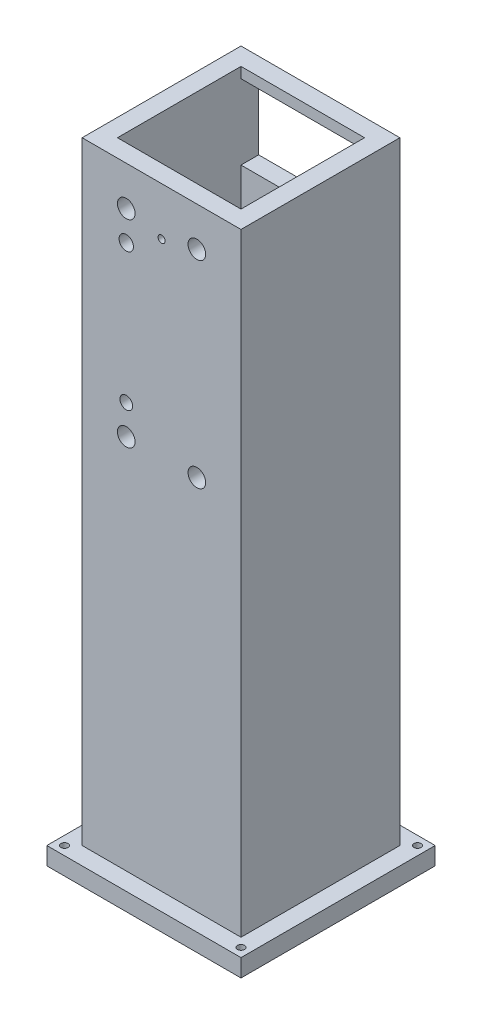
ISO-10303-21;
HEADER;
FILE_DESCRIPTION(('STEP AP214'),'2;1');
FILE_NAME('part.step','',(''),(''),'','','');
FILE_SCHEMA(('AUTOMOTIVE_DESIGN { 1 0 10303 214 1 1 1 1 }'));
ENDSEC;
DATA;
#1=APPLICATION_CONTEXT('core data for automotive mechanical design processes');
#2=APPLICATION_PROTOCOL_DEFINITION('international standard','automotive_design',2000,#1);
#3=PRODUCT_CONTEXT('',#1,'mechanical');
#4=PRODUCT('Part','Part','',(#3));
#5=PRODUCT_RELATED_PRODUCT_CATEGORY('part','',(#4));
#6=PRODUCT_DEFINITION_FORMATION('','',#4);
#7=PRODUCT_DEFINITION_CONTEXT('part definition',#1,'design');
#8=PRODUCT_DEFINITION('design','',#6,#7);
#9=PRODUCT_DEFINITION_SHAPE('','',#8);
#10=(LENGTH_UNIT() NAMED_UNIT(*) SI_UNIT(.MILLI.,.METRE.));
#11=(NAMED_UNIT(*) PLANE_ANGLE_UNIT() SI_UNIT($,.RADIAN.));
#12=(NAMED_UNIT(*) SI_UNIT($,.STERADIAN.) SOLID_ANGLE_UNIT());
#13=UNCERTAINTY_MEASURE_WITH_UNIT(LENGTH_MEASURE(1.E-05),#10,'distance_accuracy_value','');
#14=(GEOMETRIC_REPRESENTATION_CONTEXT(3) GLOBAL_UNCERTAINTY_ASSIGNED_CONTEXT((#13)) GLOBAL_UNIT_ASSIGNED_CONTEXT((#10,
#11,#12)) REPRESENTATION_CONTEXT('',''));
#15=CARTESIAN_POINT('',(0.,0.,0.));
#16=DIRECTION('',(0.,0.,1.));
#17=DIRECTION('',(1.,0.,0.));
#18=AXIS2_PLACEMENT_3D('',#15,#16,#17);
#19=CARTESIAN_POINT('',(-17.5,0.,-17.5));
#20=DIRECTION('',(0.,0.,1.));
#21=DIRECTION('',(1.,0.,0.));
#22=AXIS2_PLACEMENT_3D('',#19,#20,#21);
#23=PLANE('',#22);
#24=DIRECTION('',(1.,0.,0.));
#25=VECTOR('',#24,1.);
#26=CARTESIAN_POINT('',(-17.5,273.612120728358,-17.5));
#27=LINE('',#26,#25);
#28=CARTESIAN_POINT('',(-17.5,273.612120728358,-17.5));
#29=VERTEX_POINT('',#28);
#30=CARTESIAN_POINT('',(17.5,273.612120728358,-17.5));
#31=VERTEX_POINT('',#30);
#32=EDGE_CURVE('E267',#29,#31,#27,.T.);
#33=ORIENTED_EDGE('',*,*,#32,.F.);
#34=DIRECTION('',(0.,1.,0.));
#35=VECTOR('',#34,1.);
#36=CARTESIAN_POINT('',(-17.5,0.,-17.5));
#37=LINE('',#36,#35);
#38=CARTESIAN_POINT('',(-17.5,270.587205010945,-17.5));
#39=VERTEX_POINT('',#38);
#40=EDGE_CURVE('E312',#39,#29,#37,.T.);
#41=ORIENTED_EDGE('',*,*,#40,.F.);
#42=DIRECTION('',(1.,0.,0.));
#43=VECTOR('',#42,1.);
#44=CARTESIAN_POINT('',(-17.5,270.587205010945,-17.5));
#45=LINE('',#44,#43);
#46=CARTESIAN_POINT('',(17.5,270.587205010945,-17.5));
#47=VERTEX_POINT('',#46);
#48=EDGE_CURVE('E331',#39,#47,#45,.T.);
#49=ORIENTED_EDGE('',*,*,#48,.T.);
#50=DIRECTION('',(0.,1.,0.));
#51=VECTOR('',#50,1.);
#52=CARTESIAN_POINT('',(17.5,0.,-17.5));
#53=LINE('',#52,#51);
#54=EDGE_CURVE('E308',#47,#31,#53,.T.);
#55=ORIENTED_EDGE('',*,*,#54,.T.);
#56=EDGE_LOOP('',(#33,#41,#49,#55));
#57=FACE_BOUND('',#56,.T.);
#58=ADVANCED_FACE('F49',(#57),#23,.T.);
#59=CARTESIAN_POINT('',(22.5,300.,22.5));
#60=DIRECTION('',(-1.,0.,0.));
#61=DIRECTION('',(0.,0.,1.));
#62=AXIS2_PLACEMENT_3D('',#59,#60,#61);
#63=PLANE('',#62);
#64=DIRECTION('',(0.,-1.,0.));
#65=VECTOR('',#64,1.);
#66=CARTESIAN_POINT('',(22.5,300.,22.5));
#67=LINE('',#66,#65);
#68=CARTESIAN_POINT('',(22.5,273.612120728358,22.5));
#69=VERTEX_POINT('',#68);
#70=CARTESIAN_POINT('',(22.5,100.,22.5));
#71=VERTEX_POINT('',#70);
#72=EDGE_CURVE('E316',#69,#71,#67,.T.);
#73=ORIENTED_EDGE('',*,*,#72,.T.);
#74=DIRECTION('',(0.,0.,1.));
#75=VECTOR('',#74,1.);
#76=CARTESIAN_POINT('',(22.5,100.,22.5));
#77=LINE('',#76,#75);
#78=CARTESIAN_POINT('',(22.5,100.,-22.5));
#79=VERTEX_POINT('',#78);
#80=EDGE_CURVE('E217',#79,#71,#77,.T.);
#81=ORIENTED_EDGE('',*,*,#80,.F.);
#82=DIRECTION('',(0.,-1.,0.));
#83=VECTOR('',#82,1.);
#84=CARTESIAN_POINT('',(22.5,300.,-22.5));
#85=LINE('',#84,#83);
#86=CARTESIAN_POINT('',(22.5,273.612120728358,-22.5));
#87=VERTEX_POINT('',#86);
#88=EDGE_CURVE('E327',#87,#79,#85,.T.);
#89=ORIENTED_EDGE('',*,*,#88,.F.);
#90=DIRECTION('',(0.,0.,1.));
#91=VECTOR('',#90,1.);
#92=CARTESIAN_POINT('',(22.5,273.612120728358,-22.5));
#93=LINE('',#92,#91);
#94=EDGE_CURVE('E255',#87,#69,#93,.T.);
#95=ORIENTED_EDGE('',*,*,#94,.T.);
#96=EDGE_LOOP('',(#73,#81,#89,#95));
#97=FACE_BOUND('',#96,.T.);
#98=ADVANCED_FACE('F51',(#97),#63,.F.);
#99=CARTESIAN_POINT('',(-22.5,300.,-22.5));
#100=DIRECTION('',(0.,0.,1.));
#101=DIRECTION('',(1.,0.,0.));
#102=AXIS2_PLACEMENT_3D('',#99,#100,#101);
#103=PLANE('',#102);
#104=CARTESIAN_POINT('',(-10.,206.502607410294,-22.5));
#105=DIRECTION('',(0.,0.,1.));
#106=DIRECTION('',(1.,0.,0.));
#107=AXIS2_PLACEMENT_3D('',#104,#105,#106);
#108=CIRCLE('',#107,2.5);
#109=CARTESIAN_POINT('',(-7.5,206.502607410294,-22.5));
#110=VERTEX_POINT('',#109);
#111=EDGE_CURVE('E366',#110,#110,#108,.T.);
#112=ORIENTED_EDGE('',*,*,#111,.T.);
#113=EDGE_LOOP('',(#112));
#114=FACE_BOUND('',#113,.T.);
#115=CARTESIAN_POINT('',(-10.,214.902607410294,-22.5));
#116=DIRECTION('',(0.,0.,1.));
#117=DIRECTION('',(1.,0.,0.));
#118=AXIS2_PLACEMENT_3D('',#115,#116,#117);
#119=CIRCLE('',#118,1.79330821876043);
#120=CARTESIAN_POINT('',(-8.20669178123957,214.902607410294,-22.5));
#121=VERTEX_POINT('',#120);
#122=EDGE_CURVE('E361',#121,#121,#119,.T.);
#123=ORIENTED_EDGE('',*,*,#122,.T.);
#124=EDGE_LOOP('',(#123));
#125=FACE_BOUND('',#124,.T.);
#126=CARTESIAN_POINT('',(10.,206.502607410294,-22.5));
#127=DIRECTION('',(0.,0.,1.));
#128=DIRECTION('',(1.,0.,0.));
#129=AXIS2_PLACEMENT_3D('',#126,#127,#128);
#130=CIRCLE('',#129,2.5);
#131=CARTESIAN_POINT('',(12.5,206.502607410294,-22.5));
#132=VERTEX_POINT('',#131);
#133=EDGE_CURVE('E355',#132,#132,#130,.T.);
#134=ORIENTED_EDGE('',*,*,#133,.T.);
#135=EDGE_LOOP('',(#134));
#136=FACE_BOUND('',#135,.T.);
#137=DIRECTION('',(0.,1.,0.));
#138=VECTOR('',#137,1.);
#139=CARTESIAN_POINT('',(-17.5,249.412794989055,-22.5));
#140=LINE('',#139,#138);
#141=CARTESIAN_POINT('',(-17.5,249.412794989055,-22.5));
#142=VERTEX_POINT('',#141);
#143=CARTESIAN_POINT('',(-17.5,270.587205010945,-22.5));
#144=VERTEX_POINT('',#143);
#145=EDGE_CURVE('E278',#142,#144,#140,.T.);
#146=ORIENTED_EDGE('',*,*,#145,.F.);
#147=DIRECTION('',(-1.,0.,0.));
#148=VECTOR('',#147,1.);
#149=CARTESIAN_POINT('',(17.5,249.412794989055,-22.5));
#150=LINE('',#149,#148);
#151=CARTESIAN_POINT('',(17.5,249.412794989055,-22.5));
#152=VERTEX_POINT('',#151);
#153=EDGE_CURVE('E275',#152,#142,#150,.T.);
#154=ORIENTED_EDGE('',*,*,#153,.F.);
#155=DIRECTION('',(0.,1.,0.));
#156=VECTOR('',#155,1.);
#157=CARTESIAN_POINT('',(17.5,249.412794989055,-22.5));
#158=LINE('',#157,#156);
#159=CARTESIAN_POINT('',(17.5,270.587205010945,-22.5));
#160=VERTEX_POINT('',#159);
#161=EDGE_CURVE('E286',#152,#160,#158,.T.);
#162=ORIENTED_EDGE('',*,*,#161,.T.);
#163=DIRECTION('',(-1.,0.,0.));
#164=VECTOR('',#163,1.);
#165=CARTESIAN_POINT('',(17.5,270.587205010945,-22.5));
#166=LINE('',#165,#164);
#167=EDGE_CURVE('E282',#160,#144,#166,.T.);
#168=ORIENTED_EDGE('',*,*,#167,.T.);
#169=EDGE_LOOP('',(#146,#154,#162,#168));
#170=FACE_BOUND('',#169,.T.);
#171=ORIENTED_EDGE('',*,*,#88,.T.);
#172=DIRECTION('',(1.,0.,0.));
#173=VECTOR('',#172,1.);
#174=CARTESIAN_POINT('',(-22.5,100.,-22.5));
#175=LINE('',#174,#173);
#176=CARTESIAN_POINT('',(-22.5,100.,-22.5));
#177=VERTEX_POINT('',#176);
#178=EDGE_CURVE('E230',#177,#79,#175,.T.);
#179=ORIENTED_EDGE('',*,*,#178,.F.);
#180=DIRECTION('',(0.,-1.,0.));
#181=VECTOR('',#180,1.);
#182=CARTESIAN_POINT('',(-22.5,300.,-22.5));
#183=LINE('',#182,#181);
#184=CARTESIAN_POINT('',(-22.5,273.612120728358,-22.5));
#185=VERTEX_POINT('',#184);
#186=EDGE_CURVE('E323',#185,#177,#183,.T.);
#187=ORIENTED_EDGE('',*,*,#186,.F.);
#188=DIRECTION('',(1.,0.,0.));
#189=VECTOR('',#188,1.);
#190=CARTESIAN_POINT('',(-22.5,273.612120728358,-22.5));
#191=LINE('',#190,#189);
#192=EDGE_CURVE('E249',#185,#87,#191,.T.);
#193=ORIENTED_EDGE('',*,*,#192,.T.);
#194=EDGE_LOOP('',(#171,#179,#187,#193));
#195=FACE_BOUND('',#194,.T.);
#196=ADVANCED_FACE('F447',(#114,#125,#136,#170,#195),#103,.F.);
#197=CARTESIAN_POINT('',(-22.5,300.,22.5));
#198=DIRECTION('',(1.,0.,0.));
#199=DIRECTION('',(0.,0.,-1.));
#200=AXIS2_PLACEMENT_3D('',#197,#198,#199);
#201=PLANE('',#200);
#202=ORIENTED_EDGE('',*,*,#186,.T.);
#203=DIRECTION('',(0.,0.,1.));
#204=VECTOR('',#203,1.);
#205=CARTESIAN_POINT('',(-22.5,100.,22.5));
#206=LINE('',#205,#204);
#207=CARTESIAN_POINT('',(-22.5,100.,22.5));
#208=VERTEX_POINT('',#207);
#209=EDGE_CURVE('E227',#177,#208,#206,.T.);
#210=ORIENTED_EDGE('',*,*,#209,.T.);
#211=DIRECTION('',(0.,-1.,0.));
#212=VECTOR('',#211,1.);
#213=CARTESIAN_POINT('',(-22.5,300.,22.5));
#214=LINE('',#213,#212);
#215=CARTESIAN_POINT('',(-22.5,273.612120728358,22.5));
#216=VERTEX_POINT('',#215);
#217=EDGE_CURVE('E319',#216,#208,#214,.T.);
#218=ORIENTED_EDGE('',*,*,#217,.F.);
#219=DIRECTION('',(0.,0.,1.));
#220=VECTOR('',#219,1.);
#221=CARTESIAN_POINT('',(-22.5,273.612120728358,-22.5));
#222=LINE('',#221,#220);
#223=EDGE_CURVE('E67',#185,#216,#222,.T.);
#224=ORIENTED_EDGE('',*,*,#223,.F.);
#225=EDGE_LOOP('',(#202,#210,#218,#224));
#226=FACE_BOUND('',#225,.T.);
#227=ADVANCED_FACE('F444',(#226),#201,.F.);
#228=CARTESIAN_POINT('',(-22.5,300.,22.5));
#229=DIRECTION('',(0.,0.,-1.));
#230=DIRECTION('',(-1.,0.,0.));
#231=AXIS2_PLACEMENT_3D('',#228,#229,#230);
#232=PLANE('',#231);
#233=CARTESIAN_POINT('',(10.,262.502607410294,22.5));
#234=DIRECTION('',(0.,0.,-1.));
#235=DIRECTION('',(-1.,0.,0.));
#236=AXIS2_PLACEMENT_3D('',#233,#234,#235);
#237=CIRCLE('',#236,2.5);
#238=CARTESIAN_POINT('',(7.5,262.502607410294,22.5));
#239=VERTEX_POINT('',#238);
#240=EDGE_CURVE('E384',#239,#239,#237,.T.);
#241=ORIENTED_EDGE('',*,*,#240,.T.);
#242=EDGE_LOOP('',(#241));
#243=FACE_BOUND('',#242,.T.);
#244=CARTESIAN_POINT('',(-10.,206.502607410294,22.5));
#245=DIRECTION('',(0.,0.,-1.));
#246=DIRECTION('',(-1.,0.,0.));
#247=AXIS2_PLACEMENT_3D('',#244,#245,#246);
#248=CIRCLE('',#247,2.5);
#249=CARTESIAN_POINT('',(-12.5,206.502607410294,22.5));
#250=VERTEX_POINT('',#249);
#251=EDGE_CURVE('E590',#250,#250,#248,.T.);
#252=ORIENTED_EDGE('',*,*,#251,.T.);
#253=EDGE_LOOP('',(#252));
#254=FACE_BOUND('',#253,.T.);
#255=CARTESIAN_POINT('',(-10.,214.902607410294,22.5));
#256=DIRECTION('',(0.,0.,-1.));
#257=DIRECTION('',(-1.,0.,0.));
#258=AXIS2_PLACEMENT_3D('',#255,#256,#257);
#259=CIRCLE('',#258,1.79330821876043);
#260=CARTESIAN_POINT('',(-11.7933082187604,214.902607410294,22.5));
#261=VERTEX_POINT('',#260);
#262=EDGE_CURVE('E594',#261,#261,#259,.T.);
#263=ORIENTED_EDGE('',*,*,#262,.T.);
#264=EDGE_LOOP('',(#263));
#265=FACE_BOUND('',#264,.T.);
#266=CARTESIAN_POINT('',(-10.,254.102607410294,22.5));
#267=DIRECTION('',(0.,0.,-1.));
#268=DIRECTION('',(-1.,0.,0.));
#269=AXIS2_PLACEMENT_3D('',#266,#267,#268);
#270=CIRCLE('',#269,2.02999999999999);
#271=CARTESIAN_POINT('',(-12.03,254.102607410294,22.5));
#272=VERTEX_POINT('',#271);
#273=EDGE_CURVE('E370',#272,#272,#270,.T.);
#274=ORIENTED_EDGE('',*,*,#273,.T.);
#275=EDGE_LOOP('',(#274));
#276=FACE_BOUND('',#275,.T.);
#277=CARTESIAN_POINT('',(10.,206.502607410294,22.5));
#278=DIRECTION('',(0.,0.,-1.));
#279=DIRECTION('',(-1.,0.,0.));
#280=AXIS2_PLACEMENT_3D('',#277,#278,#279);
#281=CIRCLE('',#280,2.5);
#282=CARTESIAN_POINT('',(7.5,206.502607410294,22.5));
#283=VERTEX_POINT('',#282);
#284=EDGE_CURVE('E599',#283,#283,#281,.T.);
#285=ORIENTED_EDGE('',*,*,#284,.T.);
#286=EDGE_LOOP('',(#285));
#287=FACE_BOUND('',#286,.T.);
#288=CARTESIAN_POINT('',(-10.,262.502607410294,22.5));
#289=DIRECTION('',(0.,0.,-1.));
#290=DIRECTION('',(-1.,0.,0.));
#291=AXIS2_PLACEMENT_3D('',#288,#289,#290);
#292=CIRCLE('',#291,2.5);
#293=CARTESIAN_POINT('',(-12.5,262.502607410294,22.5));
#294=VERTEX_POINT('',#293);
#295=EDGE_CURVE('E365',#294,#294,#292,.T.);
#296=ORIENTED_EDGE('',*,*,#295,.T.);
#297=EDGE_LOOP('',(#296));
#298=FACE_BOUND('',#297,.T.);
#299=CARTESIAN_POINT('',(0.,260.,22.5));
#300=DIRECTION('',(0.,0.,1.));
#301=DIRECTION('',(1.,0.,0.));
#302=AXIS2_PLACEMENT_3D('',#299,#300,#301);
#303=CIRCLE('',#302,1.);
#304=CARTESIAN_POINT('',(1.,260.,22.5));
#305=VERTEX_POINT('',#304);
#306=EDGE_CURVE('E270',#305,#305,#303,.T.);
#307=ORIENTED_EDGE('',*,*,#306,.F.);
#308=EDGE_LOOP('',(#307));
#309=FACE_BOUND('',#308,.T.);
#310=ORIENTED_EDGE('',*,*,#217,.T.);
#311=DIRECTION('',(1.,0.,0.));
#312=VECTOR('',#311,1.);
#313=CARTESIAN_POINT('',(-22.5,100.,22.5));
#314=LINE('',#313,#312);
#315=EDGE_CURVE('E231',#208,#71,#314,.T.);
#316=ORIENTED_EDGE('',*,*,#315,.T.);
#317=ORIENTED_EDGE('',*,*,#72,.F.);
#318=DIRECTION('',(1.,0.,0.));
#319=VECTOR('',#318,1.);
#320=CARTESIAN_POINT('',(-22.5,273.612120728358,22.5));
#321=LINE('',#320,#319);
#322=EDGE_CURVE('E248',#216,#69,#321,.T.);
#323=ORIENTED_EDGE('',*,*,#322,.F.);
#324=EDGE_LOOP('',(#310,#316,#317,#323));
#325=FACE_BOUND('',#324,.T.);
#326=ADVANCED_FACE('F441',(#243,#254,#265,#276,#287,#298,#309,#325),#232,.F.);
#327=CARTESIAN_POINT('',(-17.5,0.,17.5));
#328=DIRECTION('',(1.,0.,0.));
#329=DIRECTION('',(0.,0.,-1.));
#330=AXIS2_PLACEMENT_3D('',#327,#328,#329);
#331=PLANE('',#330);
#332=DIRECTION('',(0.,0.,1.));
#333=VECTOR('',#332,1.);
#334=CARTESIAN_POINT('',(-17.5,100.,17.5));
#335=LINE('',#334,#333);
#336=CARTESIAN_POINT('',(-17.5,100.,-17.5));
#337=VERTEX_POINT('',#336);
#338=CARTESIAN_POINT('',(-17.5,100.,17.5));
#339=VERTEX_POINT('',#338);
#340=EDGE_CURVE('E241',#337,#339,#335,.T.);
#341=ORIENTED_EDGE('',*,*,#340,.F.);
#342=CARTESIAN_POINT('',(-17.5,249.412794989055,-17.5));
#343=VERTEX_POINT('',#342);
#344=EDGE_CURVE('E313',#337,#343,#37,.T.);
#345=ORIENTED_EDGE('',*,*,#344,.T.);
#346=DIRECTION('',(0.,0.,-1.));
#347=VECTOR('',#346,1.);
#348=CARTESIAN_POINT('',(-17.5,249.412794989055,-12.5));
#349=LINE('',#348,#347);
#350=EDGE_CURVE('E290',#343,#142,#349,.T.);
#351=ORIENTED_EDGE('',*,*,#350,.T.);
#352=ORIENTED_EDGE('',*,*,#145,.T.);
#353=DIRECTION('',(0.,0.,-1.));
#354=VECTOR('',#353,1.);
#355=CARTESIAN_POINT('',(-17.5,270.587205010945,-12.5));
#356=LINE('',#355,#354);
#357=EDGE_CURVE('E298',#39,#144,#356,.T.);
#358=ORIENTED_EDGE('',*,*,#357,.F.);
#359=ORIENTED_EDGE('',*,*,#40,.T.);
#360=DIRECTION('',(0.,0.,-1.));
#361=VECTOR('',#360,1.);
#362=CARTESIAN_POINT('',(-17.5,273.612120728358,17.5));
#363=LINE('',#362,#361);
#364=CARTESIAN_POINT('',(-17.5,273.612120728358,17.5));
#365=VERTEX_POINT('',#364);
#366=EDGE_CURVE('E264',#365,#29,#363,.T.);
#367=ORIENTED_EDGE('',*,*,#366,.F.);
#368=DIRECTION('',(0.,1.,0.));
#369=VECTOR('',#368,1.);
#370=CARTESIAN_POINT('',(-17.5,0.,17.5));
#371=LINE('',#370,#369);
#372=EDGE_CURVE('E294',#339,#365,#371,.T.);
#373=ORIENTED_EDGE('',*,*,#372,.F.);
#374=EDGE_LOOP('',(#341,#345,#351,#352,#358,#359,#367,#373));
#375=FACE_BOUND('',#374,.T.);
#376=ADVANCED_FACE('F505',(#375),#331,.T.);
#377=CARTESIAN_POINT('',(17.5,0.,17.5));
#378=DIRECTION('',(1.,0.,0.));
#379=DIRECTION('',(0.,0.,-1.));
#380=AXIS2_PLACEMENT_3D('',#377,#378,#379);
#381=PLANE('',#380);
#382=CARTESIAN_POINT('',(17.5,100.,-17.5));
#383=VERTEX_POINT('',#382);
#384=CARTESIAN_POINT('',(17.5,249.412794989055,-17.5));
#385=VERTEX_POINT('',#384);
#386=EDGE_CURVE('E309',#383,#385,#53,.T.);
#387=ORIENTED_EDGE('',*,*,#386,.F.);
#388=DIRECTION('',(0.,0.,1.));
#389=VECTOR('',#388,1.);
#390=CARTESIAN_POINT('',(17.5,100.,17.5));
#391=LINE('',#390,#389);
#392=CARTESIAN_POINT('',(17.5,100.,17.5));
#393=VERTEX_POINT('',#392);
#394=EDGE_CURVE('E235',#383,#393,#391,.T.);
#395=ORIENTED_EDGE('',*,*,#394,.T.);
#396=DIRECTION('',(0.,1.,0.));
#397=VECTOR('',#396,1.);
#398=CARTESIAN_POINT('',(17.5,0.,17.5));
#399=LINE('',#398,#397);
#400=CARTESIAN_POINT('',(17.5,273.612120728358,17.5));
#401=VERTEX_POINT('',#400);
#402=EDGE_CURVE('E75',#393,#401,#399,.T.);
#403=ORIENTED_EDGE('',*,*,#402,.T.);
#404=DIRECTION('',(0.,0.,-1.));
#405=VECTOR('',#404,1.);
#406=CARTESIAN_POINT('',(17.5,273.612120728358,17.5));
#407=LINE('',#406,#405);
#408=EDGE_CURVE('E259',#401,#31,#407,.T.);
#409=ORIENTED_EDGE('',*,*,#408,.T.);
#410=ORIENTED_EDGE('',*,*,#54,.F.);
#411=DIRECTION('',(0.,0.,-1.));
#412=VECTOR('',#411,1.);
#413=CARTESIAN_POINT('',(17.5,270.587205010945,-12.5));
#414=LINE('',#413,#412);
#415=EDGE_CURVE('E295',#47,#160,#414,.T.);
#416=ORIENTED_EDGE('',*,*,#415,.T.);
#417=ORIENTED_EDGE('',*,*,#161,.F.);
#418=DIRECTION('',(0.,0.,-1.));
#419=VECTOR('',#418,1.);
#420=CARTESIAN_POINT('',(17.5,249.412794989055,-12.5));
#421=LINE('',#420,#419);
#422=EDGE_CURVE('E291',#385,#152,#421,.T.);
#423=ORIENTED_EDGE('',*,*,#422,.F.);
#424=EDGE_LOOP('',(#387,#395,#403,#409,#410,#416,#417,#423));
#425=FACE_BOUND('',#424,.T.);
#426=ADVANCED_FACE('F485',(#425),#381,.F.);
#427=CARTESIAN_POINT('',(-17.5,0.,17.5));
#428=DIRECTION('',(0.,0.,1.));
#429=DIRECTION('',(1.,0.,0.));
#430=AXIS2_PLACEMENT_3D('',#427,#428,#429);
#431=PLANE('',#430);
#432=CARTESIAN_POINT('',(10.,262.502607410294,17.5));
#433=DIRECTION('',(0.,0.,1.));
#434=DIRECTION('',(1.,0.,0.));
#435=AXIS2_PLACEMENT_3D('',#432,#433,#434);
#436=CIRCLE('',#435,2.5);
#437=CARTESIAN_POINT('',(12.5,262.502607410294,17.5));
#438=VERTEX_POINT('',#437);
#439=EDGE_CURVE('E53',#438,#438,#436,.T.);
#440=ORIENTED_EDGE('',*,*,#439,.T.);
#441=EDGE_LOOP('',(#440));
#442=FACE_BOUND('',#441,.T.);
#443=CARTESIAN_POINT('',(-10.,206.502607410294,17.5));
#444=DIRECTION('',(0.,0.,1.));
#445=DIRECTION('',(1.,0.,0.));
#446=AXIS2_PLACEMENT_3D('',#443,#444,#445);
#447=CIRCLE('',#446,2.5);
#448=CARTESIAN_POINT('',(-7.5,206.502607410294,17.5));
#449=VERTEX_POINT('',#448);
#450=EDGE_CURVE('E360',#449,#449,#447,.T.);
#451=ORIENTED_EDGE('',*,*,#450,.T.);
#452=EDGE_LOOP('',(#451));
#453=FACE_BOUND('',#452,.T.);
#454=CARTESIAN_POINT('',(-10.,214.902607410294,17.5));
#455=DIRECTION('',(0.,0.,1.));
#456=DIRECTION('',(1.,0.,0.));
#457=AXIS2_PLACEMENT_3D('',#454,#455,#456);
#458=CIRCLE('',#457,1.79330821876043);
#459=CARTESIAN_POINT('',(-8.20669178123957,214.902607410294,17.5));
#460=VERTEX_POINT('',#459);
#461=EDGE_CURVE('E354',#460,#460,#458,.T.);
#462=ORIENTED_EDGE('',*,*,#461,.T.);
#463=EDGE_LOOP('',(#462));
#464=FACE_BOUND('',#463,.T.);
#465=CARTESIAN_POINT('',(-10.,254.102607410294,17.5));
#466=DIRECTION('',(0.,0.,1.));
#467=DIRECTION('',(1.,0.,0.));
#468=AXIS2_PLACEMENT_3D('',#465,#466,#467);
#469=CIRCLE('',#468,2.02999999999999);
#470=CARTESIAN_POINT('',(-7.97000000000001,254.102607410294,17.5));
#471=VERTEX_POINT('',#470);
#472=EDGE_CURVE('E367',#471,#471,#469,.T.);
#473=ORIENTED_EDGE('',*,*,#472,.T.);
#474=EDGE_LOOP('',(#473));
#475=FACE_BOUND('',#474,.T.);
#476=CARTESIAN_POINT('',(10.,206.502607410294,17.5));
#477=DIRECTION('',(0.,0.,1.));
#478=DIRECTION('',(1.,0.,0.));
#479=AXIS2_PLACEMENT_3D('',#476,#477,#478);
#480=CIRCLE('',#479,2.5);
#481=CARTESIAN_POINT('',(12.5,206.502607410294,17.5));
#482=VERTEX_POINT('',#481);
#483=EDGE_CURVE('E349',#482,#482,#480,.T.);
#484=ORIENTED_EDGE('',*,*,#483,.T.);
#485=EDGE_LOOP('',(#484));
#486=FACE_BOUND('',#485,.T.);
#487=CARTESIAN_POINT('',(-10.,262.502607410294,17.5));
#488=DIRECTION('',(0.,0.,1.));
#489=DIRECTION('',(1.,0.,0.));
#490=AXIS2_PLACEMENT_3D('',#487,#488,#489);
#491=CIRCLE('',#490,2.5);
#492=CARTESIAN_POINT('',(-7.5,262.502607410294,17.5));
#493=VERTEX_POINT('',#492);
#494=EDGE_CURVE('E362',#493,#493,#491,.T.);
#495=ORIENTED_EDGE('',*,*,#494,.T.);
#496=EDGE_LOOP('',(#495));
#497=FACE_BOUND('',#496,.T.);
#498=CARTESIAN_POINT('',(0.,260.,17.5));
#499=DIRECTION('',(0.,0.,1.));
#500=DIRECTION('',(1.,0.,0.));
#501=AXIS2_PLACEMENT_3D('',#498,#499,#500);
#502=CIRCLE('',#501,1.);
#503=CARTESIAN_POINT('',(1.,260.,17.5));
#504=VERTEX_POINT('',#503);
#505=EDGE_CURVE('E274',#504,#504,#502,.T.);
#506=ORIENTED_EDGE('',*,*,#505,.T.);
#507=EDGE_LOOP('',(#506));
#508=FACE_BOUND('',#507,.T.);
#509=ORIENTED_EDGE('',*,*,#402,.F.);
#510=DIRECTION('',(-1.,0.,0.));
#511=VECTOR('',#510,1.);
#512=CARTESIAN_POINT('',(-17.5,100.,17.5));
#513=LINE('',#512,#511);
#514=EDGE_CURVE('E244',#393,#339,#513,.T.);
#515=ORIENTED_EDGE('',*,*,#514,.T.);
#516=ORIENTED_EDGE('',*,*,#372,.T.);
#517=DIRECTION('',(1.,0.,0.));
#518=VECTOR('',#517,1.);
#519=CARTESIAN_POINT('',(-17.5,273.612120728358,17.5));
#520=LINE('',#519,#518);
#521=EDGE_CURVE('E59',#365,#401,#520,.T.);
#522=ORIENTED_EDGE('',*,*,#521,.T.);
#523=EDGE_LOOP('',(#509,#515,#516,#522));
#524=FACE_BOUND('',#523,.T.);
#525=ADVANCED_FACE('F476',(#442,#453,#464,#475,#486,#497,#508,#524),#431,.F.);
#526=CARTESIAN_POINT('',(-10.,206.502607410294,-17.5));
#527=DIRECTION('',(0.,0.,1.));
#528=DIRECTION('',(1.,0.,0.));
#529=AXIS2_PLACEMENT_3D('',#526,#527,#528);
#530=CIRCLE('',#529,2.5);
#531=CARTESIAN_POINT('',(-7.5,206.502607410294,-17.5));
#532=VERTEX_POINT('',#531);
#533=EDGE_CURVE('E356',#532,#532,#530,.T.);
#534=ORIENTED_EDGE('',*,*,#533,.F.);
#535=EDGE_LOOP('',(#534));
#536=FACE_BOUND('',#535,.T.);
#537=CARTESIAN_POINT('',(-10.,214.902607410294,-17.5));
#538=DIRECTION('',(0.,0.,1.));
#539=DIRECTION('',(1.,0.,0.));
#540=AXIS2_PLACEMENT_3D('',#537,#538,#539);
#541=CIRCLE('',#540,1.79330821876043);
#542=CARTESIAN_POINT('',(-8.20669178123957,214.902607410294,-17.5));
#543=VERTEX_POINT('',#542);
#544=EDGE_CURVE('E350',#543,#543,#541,.T.);
#545=ORIENTED_EDGE('',*,*,#544,.F.);
#546=EDGE_LOOP('',(#545));
#547=FACE_BOUND('',#546,.T.);
#548=CARTESIAN_POINT('',(10.,206.502607410294,-17.5));
#549=DIRECTION('',(0.,0.,1.));
#550=DIRECTION('',(1.,0.,0.));
#551=AXIS2_PLACEMENT_3D('',#548,#549,#550);
#552=CIRCLE('',#551,2.5);
#553=CARTESIAN_POINT('',(12.5,206.502607410294,-17.5));
#554=VERTEX_POINT('',#553);
#555=EDGE_CURVE('E345',#554,#554,#552,.T.);
#556=ORIENTED_EDGE('',*,*,#555,.F.);
#557=EDGE_LOOP('',(#556));
#558=FACE_BOUND('',#557,.T.);
#559=DIRECTION('',(-1.,0.,0.));
#560=VECTOR('',#559,1.);
#561=CARTESIAN_POINT('',(-17.5,100.,-17.5));
#562=LINE('',#561,#560);
#563=EDGE_CURVE('E11',#383,#337,#562,.T.);
#564=ORIENTED_EDGE('',*,*,#563,.F.);
#565=ORIENTED_EDGE('',*,*,#386,.T.);
#566=DIRECTION('',(1.,0.,0.));
#567=VECTOR('',#566,1.);
#568=CARTESIAN_POINT('',(-17.5,249.412794989055,-17.5));
#569=LINE('',#568,#567);
#570=EDGE_CURVE('E335',#343,#385,#569,.T.);
#571=ORIENTED_EDGE('',*,*,#570,.F.);
#572=ORIENTED_EDGE('',*,*,#344,.F.);
#573=EDGE_LOOP('',(#564,#565,#571,#572));
#574=FACE_BOUND('',#573,.T.);
#575=ADVANCED_FACE('F467',(#536,#547,#558,#574),#23,.T.);
#576=CARTESIAN_POINT('',(17.5,249.412794989055,-12.5));
#577=DIRECTION('',(0.,-1.,0.));
#578=DIRECTION('',(0.,0.,-1.));
#579=AXIS2_PLACEMENT_3D('',#576,#577,#578);
#580=PLANE('',#579);
#581=ORIENTED_EDGE('',*,*,#570,.T.);
#582=ORIENTED_EDGE('',*,*,#422,.T.);
#583=ORIENTED_EDGE('',*,*,#153,.T.);
#584=ORIENTED_EDGE('',*,*,#350,.F.);
#585=EDGE_LOOP('',(#581,#582,#583,#584));
#586=FACE_BOUND('',#585,.T.);
#587=ADVANCED_FACE('F475',(#586),#580,.F.);
#588=CARTESIAN_POINT('',(17.5,270.587205010945,-12.5));
#589=DIRECTION('',(0.,-1.,0.));
#590=DIRECTION('',(0.,0.,-1.));
#591=AXIS2_PLACEMENT_3D('',#588,#589,#590);
#592=PLANE('',#591);
#593=ORIENTED_EDGE('',*,*,#357,.T.);
#594=ORIENTED_EDGE('',*,*,#167,.F.);
#595=ORIENTED_EDGE('',*,*,#415,.F.);
#596=ORIENTED_EDGE('',*,*,#48,.F.);
#597=EDGE_LOOP('',(#593,#594,#595,#596));
#598=FACE_BOUND('',#597,.T.);
#599=ADVANCED_FACE('F460',(#598),#592,.T.);
#600=CARTESIAN_POINT('',(0.,260.,12.5));
#601=DIRECTION('',(0.,0.,1.));
#602=DIRECTION('',(1.,0.,0.));
#603=AXIS2_PLACEMENT_3D('',#600,#601,#602);
#604=CYLINDRICAL_SURFACE('',#603,1.);
#605=ORIENTED_EDGE('',*,*,#306,.T.);
#606=EDGE_LOOP('',(#605));
#607=FACE_BOUND('',#606,.T.);
#608=ORIENTED_EDGE('',*,*,#505,.F.);
#609=EDGE_LOOP('',(#608));
#610=FACE_BOUND('',#609,.T.);
#611=ADVANCED_FACE('F452',(#607,#610),#604,.F.);
#612=CARTESIAN_POINT('',(-22.5,273.612120728358,-22.5));
#613=DIRECTION('',(0.,-1.,0.));
#614=DIRECTION('',(0.,0.,-1.));
#615=AXIS2_PLACEMENT_3D('',#612,#613,#614);
#616=PLANE('',#615);
#617=ORIENTED_EDGE('',*,*,#32,.T.);
#618=ORIENTED_EDGE('',*,*,#408,.F.);
#619=ORIENTED_EDGE('',*,*,#521,.F.);
#620=ORIENTED_EDGE('',*,*,#366,.T.);
#621=EDGE_LOOP('',(#617,#618,#619,#620));
#622=FACE_BOUND('',#621,.T.);
#623=ORIENTED_EDGE('',*,*,#322,.T.);
#624=ORIENTED_EDGE('',*,*,#94,.F.);
#625=ORIENTED_EDGE('',*,*,#192,.F.);
#626=ORIENTED_EDGE('',*,*,#223,.T.);
#627=EDGE_LOOP('',(#623,#624,#625,#626));
#628=FACE_BOUND('',#627,.T.);
#629=ADVANCED_FACE('F450',(#622,#628),#616,.F.);
#630=CARTESIAN_POINT('',(0.,100.,0.));
#631=DIRECTION('',(0.,1.,0.));
#632=DIRECTION('',(0.,0.,1.));
#633=AXIS2_PLACEMENT_3D('',#630,#631,#632);
#634=PLANE('',#633);
#635=ORIENTED_EDGE('',*,*,#394,.F.);
#636=ORIENTED_EDGE('',*,*,#563,.T.);
#637=ORIENTED_EDGE('',*,*,#340,.T.);
#638=ORIENTED_EDGE('',*,*,#514,.F.);
#639=EDGE_LOOP('',(#635,#636,#637,#638));
#640=FACE_BOUND('',#639,.T.);
#641=ADVANCED_FACE('F428',(#640),#634,.T.);
#642=CARTESIAN_POINT('',(25.,100.,-25.));
#643=DIRECTION('',(0.,1.,0.));
#644=DIRECTION('',(0.,0.,1.));
#645=AXIS2_PLACEMENT_3D('',#642,#643,#644);
#646=CIRCLE('',#645,1.);
#647=CARTESIAN_POINT('',(25.,100.,-24.));
#648=VERTEX_POINT('',#647);
#649=EDGE_CURVE('E200',#648,#648,#646,.T.);
#650=ORIENTED_EDGE('',*,*,#649,.F.);
#651=EDGE_LOOP('',(#650));
#652=FACE_BOUND('',#651,.T.);
#653=CARTESIAN_POINT('',(-25.,100.,-25.));
#654=DIRECTION('',(0.,1.,0.));
#655=DIRECTION('',(0.,0.,1.));
#656=AXIS2_PLACEMENT_3D('',#653,#654,#655);
#657=CIRCLE('',#656,1.);
#658=CARTESIAN_POINT('',(-25.,100.,-24.));
#659=VERTEX_POINT('',#658);
#660=EDGE_CURVE('E411',#659,#659,#657,.T.);
#661=ORIENTED_EDGE('',*,*,#660,.F.);
#662=EDGE_LOOP('',(#661));
#663=FACE_BOUND('',#662,.T.);
#664=CARTESIAN_POINT('',(-25.,100.,25.));
#665=DIRECTION('',(0.,1.,0.));
#666=DIRECTION('',(0.,0.,1.));
#667=AXIS2_PLACEMENT_3D('',#664,#665,#666);
#668=CIRCLE('',#667,1.);
#669=CARTESIAN_POINT('',(-25.,100.,26.));
#670=VERTEX_POINT('',#669);
#671=EDGE_CURVE('E408',#670,#670,#668,.T.);
#672=ORIENTED_EDGE('',*,*,#671,.F.);
#673=EDGE_LOOP('',(#672));
#674=FACE_BOUND('',#673,.T.);
#675=CARTESIAN_POINT('',(25.,100.,25.));
#676=DIRECTION('',(0.,1.,0.));
#677=DIRECTION('',(0.,0.,1.));
#678=AXIS2_PLACEMENT_3D('',#675,#676,#677);
#679=CIRCLE('',#678,1.);
#680=CARTESIAN_POINT('',(25.,100.,26.));
#681=VERTEX_POINT('',#680);
#682=EDGE_CURVE('E404',#681,#681,#679,.T.);
#683=ORIENTED_EDGE('',*,*,#682,.F.);
#684=EDGE_LOOP('',(#683));
#685=FACE_BOUND('',#684,.T.);
#686=DIRECTION('',(0.,0.,1.));
#687=VECTOR('',#686,1.);
#688=CARTESIAN_POINT('',(-27.5,100.,-27.5));
#689=LINE('',#688,#687);
#690=CARTESIAN_POINT('',(-27.5,100.,-27.5));
#691=VERTEX_POINT('',#690);
#692=CARTESIAN_POINT('',(-27.5,100.,27.5));
#693=VERTEX_POINT('',#692);
#694=EDGE_CURVE('E207',#691,#693,#689,.T.);
#695=ORIENTED_EDGE('',*,*,#694,.T.);
#696=DIRECTION('',(1.,0.,0.));
#697=VECTOR('',#696,1.);
#698=CARTESIAN_POINT('',(-27.5,100.,27.5));
#699=LINE('',#698,#697);
#700=CARTESIAN_POINT('',(27.5,100.,27.5));
#701=VERTEX_POINT('',#700);
#702=EDGE_CURVE('E171',#693,#701,#699,.T.);
#703=ORIENTED_EDGE('',*,*,#702,.T.);
#704=DIRECTION('',(0.,0.,1.));
#705=VECTOR('',#704,1.);
#706=CARTESIAN_POINT('',(27.5,100.,-27.5));
#707=LINE('',#706,#705);
#708=CARTESIAN_POINT('',(27.5,100.,-27.5));
#709=VERTEX_POINT('',#708);
#710=EDGE_CURVE('E197',#709,#701,#707,.T.);
#711=ORIENTED_EDGE('',*,*,#710,.F.);
#712=DIRECTION('',(1.,0.,0.));
#713=VECTOR('',#712,1.);
#714=CARTESIAN_POINT('',(-27.5,100.,-27.5));
#715=LINE('',#714,#713);
#716=EDGE_CURVE('E193',#691,#709,#715,.T.);
#717=ORIENTED_EDGE('',*,*,#716,.F.);
#718=EDGE_LOOP('',(#695,#703,#711,#717));
#719=FACE_BOUND('',#718,.T.);
#720=ORIENTED_EDGE('',*,*,#315,.F.);
#721=ORIENTED_EDGE('',*,*,#209,.F.);
#722=ORIENTED_EDGE('',*,*,#178,.T.);
#723=ORIENTED_EDGE('',*,*,#80,.T.);
#724=EDGE_LOOP('',(#720,#721,#722,#723));
#725=FACE_BOUND('',#724,.T.);
#726=ADVANCED_FACE('F425',(#652,#663,#674,#685,#719,#725),#634,.T.);
#727=CARTESIAN_POINT('',(-27.5,95.,-27.5));
#728=DIRECTION('',(-1.,0.,0.));
#729=DIRECTION('',(0.,0.,1.));
#730=AXIS2_PLACEMENT_3D('',#727,#728,#729);
#731=PLANE('',#730);
#732=ORIENTED_EDGE('',*,*,#694,.F.);
#733=DIRECTION('',(0.,1.,0.));
#734=VECTOR('',#733,1.);
#735=CARTESIAN_POINT('',(-27.5,95.,-27.5));
#736=LINE('',#735,#734);
#737=CARTESIAN_POINT('',(-27.5,95.,-27.5));
#738=VERTEX_POINT('',#737);
#739=EDGE_CURVE('E190',#738,#691,#736,.T.);
#740=ORIENTED_EDGE('',*,*,#739,.F.);
#741=DIRECTION('',(0.,0.,1.));
#742=VECTOR('',#741,1.);
#743=CARTESIAN_POINT('',(-27.5,95.,-27.5));
#744=LINE('',#743,#742);
#745=CARTESIAN_POINT('',(-27.5,95.,27.5));
#746=VERTEX_POINT('',#745);
#747=EDGE_CURVE('E183',#738,#746,#744,.T.);
#748=ORIENTED_EDGE('',*,*,#747,.T.);
#749=DIRECTION('',(0.,1.,0.));
#750=VECTOR('',#749,1.);
#751=CARTESIAN_POINT('',(-27.5,95.,27.5));
#752=LINE('',#751,#750);
#753=EDGE_CURVE('E166',#746,#693,#752,.T.);
#754=ORIENTED_EDGE('',*,*,#753,.T.);
#755=EDGE_LOOP('',(#732,#740,#748,#754));
#756=FACE_BOUND('',#755,.T.);
#757=ADVANCED_FACE('F189',(#756),#731,.T.);
#758=CARTESIAN_POINT('',(-27.5,95.,-27.5));
#759=DIRECTION('',(0.,0.,1.));
#760=DIRECTION('',(1.,0.,0.));
#761=AXIS2_PLACEMENT_3D('',#758,#759,#760);
#762=PLANE('',#761);
#763=ORIENTED_EDGE('',*,*,#716,.T.);
#764=DIRECTION('',(0.,1.,0.));
#765=VECTOR('',#764,1.);
#766=CARTESIAN_POINT('',(27.5,95.,-27.5));
#767=LINE('',#766,#765);
#768=CARTESIAN_POINT('',(27.5,95.,-27.5));
#769=VERTEX_POINT('',#768);
#770=EDGE_CURVE('E218',#769,#709,#767,.T.);
#771=ORIENTED_EDGE('',*,*,#770,.F.);
#772=DIRECTION('',(1.,0.,0.));
#773=VECTOR('',#772,1.);
#774=CARTESIAN_POINT('',(-27.5,95.,-27.5));
#775=LINE('',#774,#773);
#776=EDGE_CURVE('E178',#738,#769,#775,.T.);
#777=ORIENTED_EDGE('',*,*,#776,.F.);
#778=ORIENTED_EDGE('',*,*,#739,.T.);
#779=EDGE_LOOP('',(#763,#771,#777,#778));
#780=FACE_BOUND('',#779,.T.);
#781=ADVANCED_FACE('F733',(#780),#762,.F.);
#782=CARTESIAN_POINT('',(27.5,95.,-27.5));
#783=DIRECTION('',(-1.,0.,0.));
#784=DIRECTION('',(0.,0.,1.));
#785=AXIS2_PLACEMENT_3D('',#782,#783,#784);
#786=PLANE('',#785);
#787=ORIENTED_EDGE('',*,*,#710,.T.);
#788=DIRECTION('',(0.,1.,0.));
#789=VECTOR('',#788,1.);
#790=CARTESIAN_POINT('',(27.5,95.,27.5));
#791=LINE('',#790,#789);
#792=CARTESIAN_POINT('',(27.5,95.,27.5));
#793=VERTEX_POINT('',#792);
#794=EDGE_CURVE('E177',#793,#701,#791,.T.);
#795=ORIENTED_EDGE('',*,*,#794,.F.);
#796=DIRECTION('',(0.,0.,1.));
#797=VECTOR('',#796,1.);
#798=CARTESIAN_POINT('',(27.5,95.,-27.5));
#799=LINE('',#798,#797);
#800=EDGE_CURVE('E185',#769,#793,#799,.T.);
#801=ORIENTED_EDGE('',*,*,#800,.F.);
#802=ORIENTED_EDGE('',*,*,#770,.T.);
#803=EDGE_LOOP('',(#787,#795,#801,#802));
#804=FACE_BOUND('',#803,.T.);
#805=ADVANCED_FACE('F740',(#804),#786,.F.);
#806=CARTESIAN_POINT('',(-27.5,95.,27.5));
#807=DIRECTION('',(0.,0.,1.));
#808=DIRECTION('',(1.,0.,0.));
#809=AXIS2_PLACEMENT_3D('',#806,#807,#808);
#810=PLANE('',#809);
#811=ORIENTED_EDGE('',*,*,#702,.F.);
#812=ORIENTED_EDGE('',*,*,#753,.F.);
#813=DIRECTION('',(1.,0.,0.));
#814=VECTOR('',#813,1.);
#815=CARTESIAN_POINT('',(-27.5,95.,27.5));
#816=LINE('',#815,#814);
#817=EDGE_CURVE('E169',#746,#793,#816,.T.);
#818=ORIENTED_EDGE('',*,*,#817,.T.);
#819=ORIENTED_EDGE('',*,*,#794,.T.);
#820=EDGE_LOOP('',(#811,#812,#818,#819));
#821=FACE_BOUND('',#820,.T.);
#822=ADVANCED_FACE('F168',(#821),#810,.T.);
#823=CARTESIAN_POINT('',(0.,95.,0.));
#824=DIRECTION('',(0.,1.,0.));
#825=DIRECTION('',(0.,0.,1.));
#826=AXIS2_PLACEMENT_3D('',#823,#824,#825);
#827=PLANE('',#826);
#828=CARTESIAN_POINT('',(25.,95.,-25.));
#829=DIRECTION('',(0.,-1.,0.));
#830=DIRECTION('',(0.,0.,-1.));
#831=AXIS2_PLACEMENT_3D('',#828,#829,#830);
#832=CIRCLE('',#831,1.);
#833=CARTESIAN_POINT('',(25.,95.,-26.));
#834=VERTEX_POINT('',#833);
#835=EDGE_CURVE('E388',#834,#834,#832,.T.);
#836=ORIENTED_EDGE('',*,*,#835,.F.);
#837=EDGE_LOOP('',(#836));
#838=FACE_BOUND('',#837,.T.);
#839=CARTESIAN_POINT('',(-25.,95.,-25.));
#840=DIRECTION('',(0.,-1.,0.));
#841=DIRECTION('',(0.,0.,-1.));
#842=AXIS2_PLACEMENT_3D('',#839,#840,#841);
#843=CIRCLE('',#842,1.);
#844=CARTESIAN_POINT('',(-25.,95.,-26.));
#845=VERTEX_POINT('',#844);
#846=EDGE_CURVE('E394',#845,#845,#843,.T.);
#847=ORIENTED_EDGE('',*,*,#846,.F.);
#848=EDGE_LOOP('',(#847));
#849=FACE_BOUND('',#848,.T.);
#850=CARTESIAN_POINT('',(-25.,95.,25.));
#851=DIRECTION('',(0.,-1.,0.));
#852=DIRECTION('',(0.,0.,-1.));
#853=AXIS2_PLACEMENT_3D('',#850,#851,#852);
#854=CIRCLE('',#853,1.);
#855=CARTESIAN_POINT('',(-25.,95.,24.));
#856=VERTEX_POINT('',#855);
#857=EDGE_CURVE('E389',#856,#856,#854,.T.);
#858=ORIENTED_EDGE('',*,*,#857,.F.);
#859=EDGE_LOOP('',(#858));
#860=FACE_BOUND('',#859,.T.);
#861=CARTESIAN_POINT('',(25.,95.,25.));
#862=DIRECTION('',(0.,-1.,0.));
#863=DIRECTION('',(0.,0.,-1.));
#864=AXIS2_PLACEMENT_3D('',#861,#862,#863);
#865=CIRCLE('',#864,1.);
#866=CARTESIAN_POINT('',(25.,95.,24.));
#867=VERTEX_POINT('',#866);
#868=EDGE_CURVE('E393',#867,#867,#865,.T.);
#869=ORIENTED_EDGE('',*,*,#868,.F.);
#870=EDGE_LOOP('',(#869));
#871=FACE_BOUND('',#870,.T.);
#872=ORIENTED_EDGE('',*,*,#747,.F.);
#873=ORIENTED_EDGE('',*,*,#776,.T.);
#874=ORIENTED_EDGE('',*,*,#800,.T.);
#875=ORIENTED_EDGE('',*,*,#817,.F.);
#876=EDGE_LOOP('',(#872,#873,#874,#875));
#877=FACE_BOUND('',#876,.T.);
#878=ADVANCED_FACE('F182',(#838,#849,#860,#871,#877),#827,.F.);
#879=CARTESIAN_POINT('',(25.,273.612120728358,25.));
#880=DIRECTION('',(0.,-1.,0.));
#881=DIRECTION('',(0.,0.,-1.));
#882=AXIS2_PLACEMENT_3D('',#879,#880,#881);
#883=CYLINDRICAL_SURFACE('',#882,1.);
#884=ORIENTED_EDGE('',*,*,#682,.T.);
#885=EDGE_LOOP('',(#884));
#886=FACE_BOUND('',#885,.T.);
#887=ORIENTED_EDGE('',*,*,#868,.T.);
#888=EDGE_LOOP('',(#887));
#889=FACE_BOUND('',#888,.T.);
#890=ADVANCED_FACE('F762',(#886,#889),#883,.F.);
#891=CARTESIAN_POINT('',(-25.,273.612120728358,25.));
#892=DIRECTION('',(0.,-1.,0.));
#893=DIRECTION('',(0.,0.,-1.));
#894=AXIS2_PLACEMENT_3D('',#891,#892,#893);
#895=CYLINDRICAL_SURFACE('',#894,1.);
#896=ORIENTED_EDGE('',*,*,#671,.T.);
#897=EDGE_LOOP('',(#896));
#898=FACE_BOUND('',#897,.T.);
#899=ORIENTED_EDGE('',*,*,#857,.T.);
#900=EDGE_LOOP('',(#899));
#901=FACE_BOUND('',#900,.T.);
#902=ADVANCED_FACE('F771',(#898,#901),#895,.F.);
#903=CARTESIAN_POINT('',(-25.,273.612120728358,-25.));
#904=DIRECTION('',(0.,-1.,0.));
#905=DIRECTION('',(0.,0.,-1.));
#906=AXIS2_PLACEMENT_3D('',#903,#904,#905);
#907=CYLINDRICAL_SURFACE('',#906,1.);
#908=ORIENTED_EDGE('',*,*,#660,.T.);
#909=EDGE_LOOP('',(#908));
#910=FACE_BOUND('',#909,.T.);
#911=ORIENTED_EDGE('',*,*,#846,.T.);
#912=EDGE_LOOP('',(#911));
#913=FACE_BOUND('',#912,.T.);
#914=ADVANCED_FACE('F680',(#910,#913),#907,.F.);
#915=CARTESIAN_POINT('',(25.,273.612120728358,-25.));
#916=DIRECTION('',(0.,-1.,0.));
#917=DIRECTION('',(0.,0.,-1.));
#918=AXIS2_PLACEMENT_3D('',#915,#916,#917);
#919=CYLINDRICAL_SURFACE('',#918,1.);
#920=ORIENTED_EDGE('',*,*,#649,.T.);
#921=EDGE_LOOP('',(#920));
#922=FACE_BOUND('',#921,.T.);
#923=ORIENTED_EDGE('',*,*,#835,.T.);
#924=EDGE_LOOP('',(#923));
#925=FACE_BOUND('',#924,.T.);
#926=ADVANCED_FACE('F422',(#922,#925),#919,.F.);
#927=CARTESIAN_POINT('',(10.,206.502607410294,-27.5));
#928=DIRECTION('',(0.,0.,1.));
#929=DIRECTION('',(1.,0.,0.));
#930=AXIS2_PLACEMENT_3D('',#927,#928,#929);
#931=CYLINDRICAL_SURFACE('',#930,2.5);
#932=ORIENTED_EDGE('',*,*,#555,.T.);
#933=EDGE_LOOP('',(#932));
#934=FACE_BOUND('',#933,.T.);
#935=ORIENTED_EDGE('',*,*,#133,.F.);
#936=EDGE_LOOP('',(#935));
#937=FACE_BOUND('',#936,.T.);
#938=ADVANCED_FACE('F648',(#934,#937),#931,.F.);
#939=CARTESIAN_POINT('',(-10.,214.902607410294,-27.5));
#940=DIRECTION('',(0.,0.,1.));
#941=DIRECTION('',(1.,0.,0.));
#942=AXIS2_PLACEMENT_3D('',#939,#940,#941);
#943=CYLINDRICAL_SURFACE('',#942,1.79330821876043);
#944=ORIENTED_EDGE('',*,*,#544,.T.);
#945=EDGE_LOOP('',(#944));
#946=FACE_BOUND('',#945,.T.);
#947=ORIENTED_EDGE('',*,*,#122,.F.);
#948=EDGE_LOOP('',(#947));
#949=FACE_BOUND('',#948,.T.);
#950=ADVANCED_FACE('F638',(#946,#949),#943,.F.);
#951=CARTESIAN_POINT('',(-10.,206.502607410294,-27.5));
#952=DIRECTION('',(0.,0.,1.));
#953=DIRECTION('',(1.,0.,0.));
#954=AXIS2_PLACEMENT_3D('',#951,#952,#953);
#955=CYLINDRICAL_SURFACE('',#954,2.5);
#956=ORIENTED_EDGE('',*,*,#533,.T.);
#957=EDGE_LOOP('',(#956));
#958=FACE_BOUND('',#957,.T.);
#959=ORIENTED_EDGE('',*,*,#111,.F.);
#960=EDGE_LOOP('',(#959));
#961=FACE_BOUND('',#960,.T.);
#962=ADVANCED_FACE('F635',(#958,#961),#955,.F.);
#963=CARTESIAN_POINT('',(-10.,262.502607410294,-27.5));
#964=DIRECTION('',(0.,0.,1.));
#965=DIRECTION('',(1.,0.,0.));
#966=AXIS2_PLACEMENT_3D('',#963,#964,#965);
#967=CYLINDRICAL_SURFACE('',#966,2.5);
#968=ORIENTED_EDGE('',*,*,#494,.F.);
#969=EDGE_LOOP('',(#968));
#970=FACE_BOUND('',#969,.T.);
#971=ORIENTED_EDGE('',*,*,#295,.F.);
#972=EDGE_LOOP('',(#971));
#973=FACE_BOUND('',#972,.T.);
#974=ADVANCED_FACE('F637',(#970,#973),#967,.F.);
#975=ORIENTED_EDGE('',*,*,#483,.F.);
#976=EDGE_LOOP('',(#975));
#977=FACE_BOUND('',#976,.T.);
#978=ORIENTED_EDGE('',*,*,#284,.F.);
#979=EDGE_LOOP('',(#978));
#980=FACE_BOUND('',#979,.T.);
#981=ADVANCED_FACE('F645',(#977,#980),#931,.F.);
#982=CARTESIAN_POINT('',(-10.,254.102607410294,-27.5));
#983=DIRECTION('',(0.,0.,1.));
#984=DIRECTION('',(1.,0.,0.));
#985=AXIS2_PLACEMENT_3D('',#982,#983,#984);
#986=CYLINDRICAL_SURFACE('',#985,2.02999999999999);
#987=ORIENTED_EDGE('',*,*,#472,.F.);
#988=EDGE_LOOP('',(#987));
#989=FACE_BOUND('',#988,.T.);
#990=ORIENTED_EDGE('',*,*,#273,.F.);
#991=EDGE_LOOP('',(#990));
#992=FACE_BOUND('',#991,.T.);
#993=ADVANCED_FACE('F658',(#989,#992),#986,.F.);
#994=ORIENTED_EDGE('',*,*,#461,.F.);
#995=EDGE_LOOP('',(#994));
#996=FACE_BOUND('',#995,.T.);
#997=ORIENTED_EDGE('',*,*,#262,.F.);
#998=EDGE_LOOP('',(#997));
#999=FACE_BOUND('',#998,.T.);
#1000=ADVANCED_FACE('F651',(#996,#999),#943,.F.);
#1001=ORIENTED_EDGE('',*,*,#450,.F.);
#1002=EDGE_LOOP('',(#1001));
#1003=FACE_BOUND('',#1002,.T.);
#1004=ORIENTED_EDGE('',*,*,#251,.F.);
#1005=EDGE_LOOP('',(#1004));
#1006=FACE_BOUND('',#1005,.T.);
#1007=ADVANCED_FACE('F580',(#1003,#1006),#955,.F.);
#1008=CARTESIAN_POINT('',(10.,262.502607410294,-27.5));
#1009=DIRECTION('',(0.,0.,1.));
#1010=DIRECTION('',(1.,0.,0.));
#1011=AXIS2_PLACEMENT_3D('',#1008,#1009,#1010);
#1012=CYLINDRICAL_SURFACE('',#1011,2.5);
#1013=ORIENTED_EDGE('',*,*,#439,.F.);
#1014=EDGE_LOOP('',(#1013));
#1015=FACE_BOUND('',#1014,.T.);
#1016=ORIENTED_EDGE('',*,*,#240,.F.);
#1017=EDGE_LOOP('',(#1016));
#1018=FACE_BOUND('',#1017,.T.);
#1019=ADVANCED_FACE('F577',(#1015,#1018),#1012,.F.);
#1020=CLOSED_SHELL('',(#58,#98,#196,#227,#326,#376,#426,#525,#575,#587,#599,#611,#629,#641,#726,
#757,#781,#805,#822,#878,#890,#902,#914,#926,#938,#950,#962,#974,#981,#993,#1000,#1007,#1019));
#1021=MANIFOLD_SOLID_BREP('B2',#1020);
#1022=ADVANCED_BREP_SHAPE_REPRESENTATION('',(#18,#1021),#14);
#1023=SHAPE_DEFINITION_REPRESENTATION(#9,#1022);
ENDSEC;
END-ISO-10303-21;
